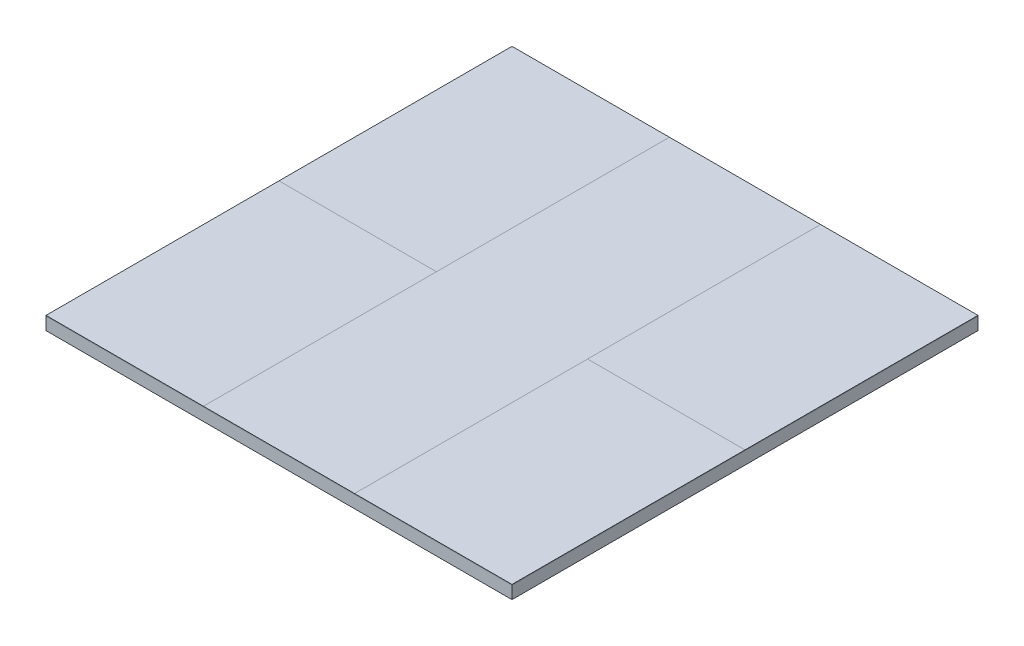
ISO-10303-21;
HEADER;
FILE_DESCRIPTION(('STEP AP214'),'2;1');
FILE_NAME('part.step','',(''),(''),'','','');
FILE_SCHEMA(('AUTOMOTIVE_DESIGN { 1 0 10303 214 1 1 1 1 }'));
ENDSEC;
DATA;
#1=APPLICATION_CONTEXT('core data for automotive mechanical design processes');
#2=APPLICATION_PROTOCOL_DEFINITION('international standard','automotive_design',2000,#1);
#3=PRODUCT_CONTEXT('',#1,'mechanical');
#4=PRODUCT('Part','Part','',(#3));
#5=PRODUCT_RELATED_PRODUCT_CATEGORY('part','',(#4));
#6=PRODUCT_DEFINITION_FORMATION('','',#4);
#7=PRODUCT_DEFINITION_CONTEXT('part definition',#1,'design');
#8=PRODUCT_DEFINITION('design','',#6,#7);
#9=PRODUCT_DEFINITION_SHAPE('','',#8);
#10=(LENGTH_UNIT() NAMED_UNIT(*) SI_UNIT(.MILLI.,.METRE.));
#11=(NAMED_UNIT(*) PLANE_ANGLE_UNIT() SI_UNIT($,.RADIAN.));
#12=(NAMED_UNIT(*) SI_UNIT($,.STERADIAN.) SOLID_ANGLE_UNIT());
#13=UNCERTAINTY_MEASURE_WITH_UNIT(LENGTH_MEASURE(1.E-05),#10,'distance_accuracy_value','');
#14=(GEOMETRIC_REPRESENTATION_CONTEXT(3) GLOBAL_UNCERTAINTY_ASSIGNED_CONTEXT((#13)) GLOBAL_UNIT_ASSIGNED_CONTEXT((#10,
#11,#12)) REPRESENTATION_CONTEXT('',''));
#15=CARTESIAN_POINT('',(0.,0.,0.));
#16=DIRECTION('',(0.,0.,1.));
#17=DIRECTION('',(1.,0.,0.));
#18=AXIS2_PLACEMENT_3D('',#15,#16,#17);
#19=CARTESIAN_POINT('',(12.,2.1,0.));
#20=DIRECTION('',(1.,0.,0.));
#21=DIRECTION('',(0.,0.,-1.));
#22=AXIS2_PLACEMENT_3D('',#19,#20,#21);
#23=PLANE('',#22);
#24=DIRECTION('',(0.,0.,1.));
#25=VECTOR('',#24,1.);
#26=CARTESIAN_POINT('',(12.,2.,0.));
#27=LINE('',#26,#25);
#28=CARTESIAN_POINT('',(12.,2.,-37.));
#29=VERTEX_POINT('',#28);
#30=CARTESIAN_POINT('',(12.,2.,0.));
#31=VERTEX_POINT('',#30);
#32=EDGE_CURVE('E108',#29,#31,#27,.T.);
#33=ORIENTED_EDGE('',*,*,#32,.T.);
#34=DIRECTION('',(0.,-1.,0.));
#35=VECTOR('',#34,1.);
#36=CARTESIAN_POINT('',(12.,2.1,0.));
#37=LINE('',#36,#35);
#38=CARTESIAN_POINT('',(12.,2.1,0.));
#39=VERTEX_POINT('',#38);
#40=EDGE_CURVE('E12',#39,#31,#37,.T.);
#41=ORIENTED_EDGE('',*,*,#40,.F.);
#42=DIRECTION('',(0.,0.,1.));
#43=VECTOR('',#42,1.);
#44=CARTESIAN_POINT('',(12.,2.1,0.));
#45=LINE('',#44,#43);
#46=CARTESIAN_POINT('',(12.,2.1,-37.));
#47=VERTEX_POINT('',#46);
#48=EDGE_CURVE('E96',#47,#39,#45,.T.);
#49=ORIENTED_EDGE('',*,*,#48,.F.);
#50=DIRECTION('',(0.,-1.,0.));
#51=VECTOR('',#50,1.);
#52=CARTESIAN_POINT('',(12.,2.1,-37.));
#53=LINE('',#52,#51);
#54=EDGE_CURVE('E104',#47,#29,#53,.T.);
#55=ORIENTED_EDGE('',*,*,#54,.T.);
#56=EDGE_LOOP('',(#33,#41,#49,#55));
#57=FACE_BOUND('',#56,.T.);
#58=ADVANCED_FACE('F45',(#57),#23,.F.);
#59=CARTESIAN_POINT('',(0.,2.1,0.));
#60=DIRECTION('',(0.,0.,-1.));
#61=DIRECTION('',(-1.,0.,0.));
#62=AXIS2_PLACEMENT_3D('',#59,#60,#61);
#63=PLANE('',#62);
#64=DIRECTION('',(1.,0.,0.));
#65=VECTOR('',#64,1.);
#66=CARTESIAN_POINT('',(0.,2.,0.));
#67=LINE('',#66,#65);
#68=CARTESIAN_POINT('',(37.,2.,0.));
#69=VERTEX_POINT('',#68);
#70=EDGE_CURVE('E100',#31,#69,#67,.T.);
#71=ORIENTED_EDGE('',*,*,#70,.T.);
#72=DIRECTION('',(0.,-1.,0.));
#73=VECTOR('',#72,1.);
#74=CARTESIAN_POINT('',(37.,2.1,0.));
#75=LINE('',#74,#73);
#76=CARTESIAN_POINT('',(37.,2.1,0.));
#77=VERTEX_POINT('',#76);
#78=EDGE_CURVE('E53',#77,#69,#75,.T.);
#79=ORIENTED_EDGE('',*,*,#78,.F.);
#80=DIRECTION('',(1.,0.,0.));
#81=VECTOR('',#80,1.);
#82=CARTESIAN_POINT('',(0.,2.1,0.));
#83=LINE('',#82,#81);
#84=EDGE_CURVE('E91',#39,#77,#83,.T.);
#85=ORIENTED_EDGE('',*,*,#84,.F.);
#86=ORIENTED_EDGE('',*,*,#40,.T.);
#87=EDGE_LOOP('',(#71,#79,#85,#86));
#88=FACE_BOUND('',#87,.T.);
#89=ADVANCED_FACE('F99',(#88),#63,.F.);
#90=CARTESIAN_POINT('',(37.,2.1,0.));
#91=DIRECTION('',(-1.,0.,0.));
#92=DIRECTION('',(0.,0.,1.));
#93=AXIS2_PLACEMENT_3D('',#90,#91,#92);
#94=PLANE('',#93);
#95=DIRECTION('',(0.,0.,-1.));
#96=VECTOR('',#95,1.);
#97=CARTESIAN_POINT('',(37.,2.,0.));
#98=LINE('',#97,#96);
#99=CARTESIAN_POINT('',(37.,2.,-37.));
#100=VERTEX_POINT('',#99);
#101=EDGE_CURVE('E78',#69,#100,#98,.T.);
#102=ORIENTED_EDGE('',*,*,#101,.T.);
#103=DIRECTION('',(0.,-1.,0.));
#104=VECTOR('',#103,1.);
#105=CARTESIAN_POINT('',(37.,2.1,-37.));
#106=LINE('',#105,#104);
#107=CARTESIAN_POINT('',(37.,2.1,-37.));
#108=VERTEX_POINT('',#107);
#109=EDGE_CURVE('E101',#108,#100,#106,.T.);
#110=ORIENTED_EDGE('',*,*,#109,.F.);
#111=DIRECTION('',(0.,0.,-1.));
#112=VECTOR('',#111,1.);
#113=CARTESIAN_POINT('',(37.,2.1,0.));
#114=LINE('',#113,#112);
#115=EDGE_CURVE('E94',#77,#108,#114,.T.);
#116=ORIENTED_EDGE('',*,*,#115,.F.);
#117=ORIENTED_EDGE('',*,*,#78,.T.);
#118=EDGE_LOOP('',(#102,#110,#116,#117));
#119=FACE_BOUND('',#118,.T.);
#120=ADVANCED_FACE('F102',(#119),#94,.F.);
#121=CARTESIAN_POINT('',(0.,2.1,-37.));
#122=DIRECTION('',(0.,0.,1.));
#123=DIRECTION('',(1.,0.,0.));
#124=AXIS2_PLACEMENT_3D('',#121,#122,#123);
#125=PLANE('',#124);
#126=DIRECTION('',(-1.,0.,0.));
#127=VECTOR('',#126,1.);
#128=CARTESIAN_POINT('',(0.,2.,-37.));
#129=LINE('',#128,#127);
#130=EDGE_CURVE('E84',#100,#29,#129,.T.);
#131=ORIENTED_EDGE('',*,*,#130,.T.);
#132=ORIENTED_EDGE('',*,*,#54,.F.);
#133=DIRECTION('',(-1.,0.,0.));
#134=VECTOR('',#133,1.);
#135=CARTESIAN_POINT('',(0.,2.1,-37.));
#136=LINE('',#135,#134);
#137=EDGE_CURVE('E61',#108,#47,#136,.T.);
#138=ORIENTED_EDGE('',*,*,#137,.F.);
#139=ORIENTED_EDGE('',*,*,#109,.T.);
#140=EDGE_LOOP('',(#131,#132,#138,#139));
#141=FACE_BOUND('',#140,.T.);
#142=ADVANCED_FACE('F115',(#141),#125,.F.);
#143=CARTESIAN_POINT('',(0.,2.1,0.));
#144=DIRECTION('',(0.,1.,0.));
#145=DIRECTION('',(0.,0.,1.));
#146=AXIS2_PLACEMENT_3D('',#143,#144,#145);
#147=PLANE('',#146);
#148=ORIENTED_EDGE('',*,*,#48,.T.);
#149=ORIENTED_EDGE('',*,*,#84,.T.);
#150=ORIENTED_EDGE('',*,*,#115,.T.);
#151=ORIENTED_EDGE('',*,*,#137,.T.);
#152=EDGE_LOOP('',(#148,#149,#150,#151));
#153=FACE_BOUND('',#152,.T.);
#154=ADVANCED_FACE('F92',(#153),#147,.T.);
#155=CARTESIAN_POINT('',(0.,2.,0.));
#156=DIRECTION('',(0.,1.,0.));
#157=DIRECTION('',(0.,0.,1.));
#158=AXIS2_PLACEMENT_3D('',#155,#156,#157);
#159=PLANE('',#158);
#160=ORIENTED_EDGE('',*,*,#32,.F.);
#161=ORIENTED_EDGE('',*,*,#130,.F.);
#162=ORIENTED_EDGE('',*,*,#101,.F.);
#163=ORIENTED_EDGE('',*,*,#70,.F.);
#164=EDGE_LOOP('',(#160,#161,#162,#163));
#165=FACE_BOUND('',#164,.T.);
#166=ADVANCED_FACE('F118',(#165),#159,.F.);
#167=CLOSED_SHELL('',(#58,#89,#120,#142,#154,#166));
#168=MANIFOLD_SOLID_BREP('B2',#167);
#169=CARTESIAN_POINT('',(12.,2.1,0.));
#170=DIRECTION('',(1.,0.,0.));
#171=DIRECTION('',(0.,0.,-1.));
#172=AXIS2_PLACEMENT_3D('',#169,#170,#171);
#173=PLANE('',#172);
#174=DIRECTION('',(0.,0.,1.));
#175=VECTOR('',#174,1.);
#176=CARTESIAN_POINT('',(12.,2.,0.));
#177=LINE('',#176,#175);
#178=CARTESIAN_POINT('',(12.,2.,-37.));
#179=VERTEX_POINT('',#178);
#180=CARTESIAN_POINT('',(12.,2.,37.));
#181=VERTEX_POINT('',#180);
#182=EDGE_CURVE('E251',#179,#181,#177,.T.);
#183=ORIENTED_EDGE('',*,*,#182,.F.);
#184=DIRECTION('',(0.,-1.,0.));
#185=VECTOR('',#184,1.);
#186=CARTESIAN_POINT('',(12.,2.1,-37.));
#187=LINE('',#186,#185);
#188=CARTESIAN_POINT('',(12.,2.1,-37.));
#189=VERTEX_POINT('',#188);
#190=EDGE_CURVE('E43',#189,#179,#187,.T.);
#191=ORIENTED_EDGE('',*,*,#190,.F.);
#192=DIRECTION('',(0.,0.,1.));
#193=VECTOR('',#192,1.);
#194=CARTESIAN_POINT('',(12.,2.1,0.));
#195=LINE('',#194,#193);
#196=CARTESIAN_POINT('',(12.,2.1,37.));
#197=VERTEX_POINT('',#196);
#198=EDGE_CURVE('E239',#189,#197,#195,.T.);
#199=ORIENTED_EDGE('',*,*,#198,.T.);
#200=DIRECTION('',(0.,-1.,0.));
#201=VECTOR('',#200,1.);
#202=CARTESIAN_POINT('',(12.,2.1,37.));
#203=LINE('',#202,#201);
#204=EDGE_CURVE('E228',#197,#181,#203,.T.);
#205=ORIENTED_EDGE('',*,*,#204,.T.);
#206=EDGE_LOOP('',(#183,#191,#199,#205));
#207=FACE_BOUND('',#206,.T.);
#208=ADVANCED_FACE('F189',(#207),#173,.T.);
#209=CARTESIAN_POINT('',(0.,2.1,-37.));
#210=DIRECTION('',(0.,0.,1.));
#211=DIRECTION('',(1.,0.,0.));
#212=AXIS2_PLACEMENT_3D('',#209,#210,#211);
#213=PLANE('',#212);
#214=DIRECTION('',(-1.,0.,0.));
#215=VECTOR('',#214,1.);
#216=CARTESIAN_POINT('',(0.,2.,-37.));
#217=LINE('',#216,#215);
#218=CARTESIAN_POINT('',(-12.,2.,-37.));
#219=VERTEX_POINT('',#218);
#220=EDGE_CURVE('E244',#179,#219,#217,.T.);
#221=ORIENTED_EDGE('',*,*,#220,.T.);
#222=DIRECTION('',(0.,-1.,0.));
#223=VECTOR('',#222,1.);
#224=CARTESIAN_POINT('',(-12.,2.1,-37.));
#225=LINE('',#224,#223);
#226=CARTESIAN_POINT('',(-12.,2.1,-37.));
#227=VERTEX_POINT('',#226);
#228=EDGE_CURVE('E197',#227,#219,#225,.T.);
#229=ORIENTED_EDGE('',*,*,#228,.F.);
#230=DIRECTION('',(-1.,0.,0.));
#231=VECTOR('',#230,1.);
#232=CARTESIAN_POINT('',(0.,2.1,-37.));
#233=LINE('',#232,#231);
#234=EDGE_CURVE('E234',#189,#227,#233,.T.);
#235=ORIENTED_EDGE('',*,*,#234,.F.);
#236=ORIENTED_EDGE('',*,*,#190,.T.);
#237=EDGE_LOOP('',(#221,#229,#235,#236));
#238=FACE_BOUND('',#237,.T.);
#239=ADVANCED_FACE('F242',(#238),#213,.F.);
#240=CARTESIAN_POINT('',(-12.,2.1,0.));
#241=DIRECTION('',(1.,0.,0.));
#242=DIRECTION('',(0.,0.,-1.));
#243=AXIS2_PLACEMENT_3D('',#240,#241,#242);
#244=PLANE('',#243);
#245=DIRECTION('',(0.,0.,1.));
#246=VECTOR('',#245,1.);
#247=CARTESIAN_POINT('',(-12.,2.,0.));
#248=LINE('',#247,#246);
#249=CARTESIAN_POINT('',(-12.,2.,37.));
#250=VERTEX_POINT('',#249);
#251=EDGE_CURVE('E221',#219,#250,#248,.T.);
#252=ORIENTED_EDGE('',*,*,#251,.T.);
#253=DIRECTION('',(0.,-1.,0.));
#254=VECTOR('',#253,1.);
#255=CARTESIAN_POINT('',(-12.,2.1,37.));
#256=LINE('',#255,#254);
#257=CARTESIAN_POINT('',(-12.,2.1,37.));
#258=VERTEX_POINT('',#257);
#259=EDGE_CURVE('E245',#258,#250,#256,.T.);
#260=ORIENTED_EDGE('',*,*,#259,.F.);
#261=DIRECTION('',(0.,0.,1.));
#262=VECTOR('',#261,1.);
#263=CARTESIAN_POINT('',(-12.,2.1,0.));
#264=LINE('',#263,#262);
#265=EDGE_CURVE('E238',#227,#258,#264,.T.);
#266=ORIENTED_EDGE('',*,*,#265,.F.);
#267=ORIENTED_EDGE('',*,*,#228,.T.);
#268=EDGE_LOOP('',(#252,#260,#266,#267));
#269=FACE_BOUND('',#268,.T.);
#270=ADVANCED_FACE('F246',(#269),#244,.F.);
#271=CARTESIAN_POINT('',(0.,2.1,37.));
#272=DIRECTION('',(0.,0.,-1.));
#273=DIRECTION('',(-1.,0.,0.));
#274=AXIS2_PLACEMENT_3D('',#271,#272,#273);
#275=PLANE('',#274);
#276=DIRECTION('',(1.,0.,0.));
#277=VECTOR('',#276,1.);
#278=CARTESIAN_POINT('',(0.,2.,37.));
#279=LINE('',#278,#277);
#280=EDGE_CURVE('E256',#250,#181,#279,.T.);
#281=ORIENTED_EDGE('',*,*,#280,.T.);
#282=ORIENTED_EDGE('',*,*,#204,.F.);
#283=DIRECTION('',(1.,0.,0.));
#284=VECTOR('',#283,1.);
#285=CARTESIAN_POINT('',(0.,2.1,37.));
#286=LINE('',#285,#284);
#287=EDGE_CURVE('E205',#258,#197,#286,.T.);
#288=ORIENTED_EDGE('',*,*,#287,.F.);
#289=ORIENTED_EDGE('',*,*,#259,.T.);
#290=EDGE_LOOP('',(#281,#282,#288,#289));
#291=FACE_BOUND('',#290,.T.);
#292=ADVANCED_FACE('F261',(#291),#275,.F.);
#293=CARTESIAN_POINT('',(0.,2.1,0.));
#294=DIRECTION('',(0.,1.,0.));
#295=DIRECTION('',(0.,0.,1.));
#296=AXIS2_PLACEMENT_3D('',#293,#294,#295);
#297=PLANE('',#296);
#298=ORIENTED_EDGE('',*,*,#198,.F.);
#299=ORIENTED_EDGE('',*,*,#234,.T.);
#300=ORIENTED_EDGE('',*,*,#265,.T.);
#301=ORIENTED_EDGE('',*,*,#287,.T.);
#302=EDGE_LOOP('',(#298,#299,#300,#301));
#303=FACE_BOUND('',#302,.T.);
#304=ADVANCED_FACE('F236',(#303),#297,.T.);
#305=CARTESIAN_POINT('',(0.,2.,0.));
#306=DIRECTION('',(0.,1.,0.));
#307=DIRECTION('',(0.,0.,1.));
#308=AXIS2_PLACEMENT_3D('',#305,#306,#307);
#309=PLANE('',#308);
#310=ORIENTED_EDGE('',*,*,#182,.T.);
#311=ORIENTED_EDGE('',*,*,#280,.F.);
#312=ORIENTED_EDGE('',*,*,#251,.F.);
#313=ORIENTED_EDGE('',*,*,#220,.F.);
#314=EDGE_LOOP('',(#310,#311,#312,#313));
#315=FACE_BOUND('',#314,.T.);
#316=ADVANCED_FACE('F263',(#315),#309,.F.);
#317=CLOSED_SHELL('',(#208,#239,#270,#292,#304,#316));
#318=MANIFOLD_SOLID_BREP('B6',#317);
#319=CARTESIAN_POINT('',(0.,2.1,0.));
#320=DIRECTION('',(0.,0.,-1.));
#321=DIRECTION('',(-1.,0.,0.));
#322=AXIS2_PLACEMENT_3D('',#319,#320,#321);
#323=PLANE('',#322);
#324=DIRECTION('',(1.,0.,0.));
#325=VECTOR('',#324,1.);
#326=CARTESIAN_POINT('',(0.,2.,0.));
#327=LINE('',#326,#325);
#328=CARTESIAN_POINT('',(-37.,2.,0.));
#329=VERTEX_POINT('',#328);
#330=CARTESIAN_POINT('',(-12.,2.,0.));
#331=VERTEX_POINT('',#330);
#332=EDGE_CURVE('E397',#329,#331,#327,.T.);
#333=ORIENTED_EDGE('',*,*,#332,.F.);
#334=DIRECTION('',(0.,-1.,0.));
#335=VECTOR('',#334,1.);
#336=CARTESIAN_POINT('',(-37.,2.1,0.));
#337=LINE('',#336,#335);
#338=CARTESIAN_POINT('',(-37.,2.1,0.));
#339=VERTEX_POINT('',#338);
#340=EDGE_CURVE('E187',#339,#329,#337,.T.);
#341=ORIENTED_EDGE('',*,*,#340,.F.);
#342=DIRECTION('',(1.,0.,0.));
#343=VECTOR('',#342,1.);
#344=CARTESIAN_POINT('',(0.,2.1,0.));
#345=LINE('',#344,#343);
#346=CARTESIAN_POINT('',(-12.,2.1,0.));
#347=VERTEX_POINT('',#346);
#348=EDGE_CURVE('E382',#339,#347,#345,.T.);
#349=ORIENTED_EDGE('',*,*,#348,.T.);
#350=DIRECTION('',(0.,-1.,0.));
#351=VECTOR('',#350,1.);
#352=CARTESIAN_POINT('',(-12.,2.1,0.));
#353=LINE('',#352,#351);
#354=EDGE_CURVE('E350',#347,#331,#353,.T.);
#355=ORIENTED_EDGE('',*,*,#354,.T.);
#356=EDGE_LOOP('',(#333,#341,#349,#355));
#357=FACE_BOUND('',#356,.T.);
#358=ADVANCED_FACE('F334',(#357),#323,.T.);
#359=CARTESIAN_POINT('',(-37.,2.1,0.));
#360=DIRECTION('',(1.,0.,0.));
#361=DIRECTION('',(0.,0.,-1.));
#362=AXIS2_PLACEMENT_3D('',#359,#360,#361);
#363=PLANE('',#362);
#364=DIRECTION('',(0.,0.,1.));
#365=VECTOR('',#364,1.);
#366=CARTESIAN_POINT('',(-37.,2.,0.));
#367=LINE('',#366,#365);
#368=CARTESIAN_POINT('',(-37.,2.,37.));
#369=VERTEX_POINT('',#368);
#370=EDGE_CURVE('E388',#329,#369,#367,.T.);
#371=ORIENTED_EDGE('',*,*,#370,.T.);
#372=DIRECTION('',(0.,-1.,0.));
#373=VECTOR('',#372,1.);
#374=CARTESIAN_POINT('',(-37.,2.1,37.));
#375=LINE('',#374,#373);
#376=CARTESIAN_POINT('',(-37.,2.1,37.));
#377=VERTEX_POINT('',#376);
#378=EDGE_CURVE('E342',#377,#369,#375,.T.);
#379=ORIENTED_EDGE('',*,*,#378,.F.);
#380=DIRECTION('',(0.,0.,1.));
#381=VECTOR('',#380,1.);
#382=CARTESIAN_POINT('',(-37.,2.1,0.));
#383=LINE('',#382,#381);
#384=EDGE_CURVE('E376',#339,#377,#383,.T.);
#385=ORIENTED_EDGE('',*,*,#384,.F.);
#386=ORIENTED_EDGE('',*,*,#340,.T.);
#387=EDGE_LOOP('',(#371,#379,#385,#386));
#388=FACE_BOUND('',#387,.T.);
#389=ADVANCED_FACE('F386',(#388),#363,.F.);
#390=CARTESIAN_POINT('',(0.,2.1,37.));
#391=DIRECTION('',(0.,0.,-1.));
#392=DIRECTION('',(-1.,0.,0.));
#393=AXIS2_PLACEMENT_3D('',#390,#391,#392);
#394=PLANE('',#393);
#395=DIRECTION('',(1.,0.,0.));
#396=VECTOR('',#395,1.);
#397=CARTESIAN_POINT('',(0.,2.,37.));
#398=LINE('',#397,#396);
#399=CARTESIAN_POINT('',(-12.,2.,37.));
#400=VERTEX_POINT('',#399);
#401=EDGE_CURVE('E400',#369,#400,#398,.T.);
#402=ORIENTED_EDGE('',*,*,#401,.T.);
#403=DIRECTION('',(0.,-1.,0.));
#404=VECTOR('',#403,1.);
#405=CARTESIAN_POINT('',(-12.,2.1,37.));
#406=LINE('',#405,#404);
#407=CARTESIAN_POINT('',(-12.,2.1,37.));
#408=VERTEX_POINT('',#407);
#409=EDGE_CURVE('E364',#408,#400,#406,.T.);
#410=ORIENTED_EDGE('',*,*,#409,.F.);
#411=DIRECTION('',(1.,0.,0.));
#412=VECTOR('',#411,1.);
#413=CARTESIAN_POINT('',(0.,2.1,37.));
#414=LINE('',#413,#412);
#415=EDGE_CURVE('E381',#377,#408,#414,.T.);
#416=ORIENTED_EDGE('',*,*,#415,.F.);
#417=ORIENTED_EDGE('',*,*,#378,.T.);
#418=EDGE_LOOP('',(#402,#410,#416,#417));
#419=FACE_BOUND('',#418,.T.);
#420=ADVANCED_FACE('F391',(#419),#394,.F.);
#421=CARTESIAN_POINT('',(-12.,2.1,0.));
#422=DIRECTION('',(1.,0.,0.));
#423=DIRECTION('',(0.,0.,-1.));
#424=AXIS2_PLACEMENT_3D('',#421,#422,#423);
#425=PLANE('',#424);
#426=DIRECTION('',(0.,0.,1.));
#427=VECTOR('',#426,1.);
#428=CARTESIAN_POINT('',(-12.,2.,0.));
#429=LINE('',#428,#427);
#430=EDGE_CURVE('E402',#331,#400,#429,.T.);
#431=ORIENTED_EDGE('',*,*,#430,.F.);
#432=ORIENTED_EDGE('',*,*,#354,.F.);
#433=DIRECTION('',(0.,0.,1.));
#434=VECTOR('',#433,1.);
#435=CARTESIAN_POINT('',(-12.,2.1,0.));
#436=LINE('',#435,#434);
#437=EDGE_CURVE('E392',#347,#408,#436,.T.);
#438=ORIENTED_EDGE('',*,*,#437,.T.);
#439=ORIENTED_EDGE('',*,*,#409,.T.);
#440=EDGE_LOOP('',(#431,#432,#438,#439));
#441=FACE_BOUND('',#440,.T.);
#442=ADVANCED_FACE('F407',(#441),#425,.T.);
#443=CARTESIAN_POINT('',(0.,2.1,0.));
#444=DIRECTION('',(0.,1.,0.));
#445=DIRECTION('',(0.,0.,1.));
#446=AXIS2_PLACEMENT_3D('',#443,#444,#445);
#447=PLANE('',#446);
#448=ORIENTED_EDGE('',*,*,#348,.F.);
#449=ORIENTED_EDGE('',*,*,#384,.T.);
#450=ORIENTED_EDGE('',*,*,#415,.T.);
#451=ORIENTED_EDGE('',*,*,#437,.F.);
#452=EDGE_LOOP('',(#448,#449,#450,#451));
#453=FACE_BOUND('',#452,.T.);
#454=ADVANCED_FACE('F378',(#453),#447,.T.);
#455=CARTESIAN_POINT('',(0.,2.,0.));
#456=DIRECTION('',(0.,1.,0.));
#457=DIRECTION('',(0.,0.,1.));
#458=AXIS2_PLACEMENT_3D('',#455,#456,#457);
#459=PLANE('',#458);
#460=ORIENTED_EDGE('',*,*,#332,.T.);
#461=ORIENTED_EDGE('',*,*,#430,.T.);
#462=ORIENTED_EDGE('',*,*,#401,.F.);
#463=ORIENTED_EDGE('',*,*,#370,.F.);
#464=EDGE_LOOP('',(#460,#461,#462,#463));
#465=FACE_BOUND('',#464,.T.);
#466=ADVANCED_FACE('F414',(#465),#459,.F.);
#467=CLOSED_SHELL('',(#358,#389,#420,#442,#454,#466));
#468=MANIFOLD_SOLID_BREP('B37',#467);
#469=CARTESIAN_POINT('',(0.,2.1,0.));
#470=DIRECTION('',(0.,0.,-1.));
#471=DIRECTION('',(-1.,0.,0.));
#472=AXIS2_PLACEMENT_3D('',#469,#470,#471);
#473=PLANE('',#472);
#474=DIRECTION('',(1.,0.,0.));
#475=VECTOR('',#474,1.);
#476=CARTESIAN_POINT('',(0.,2.,0.));
#477=LINE('',#476,#475);
#478=CARTESIAN_POINT('',(12.,2.,0.));
#479=VERTEX_POINT('',#478);
#480=CARTESIAN_POINT('',(37.,2.,0.));
#481=VERTEX_POINT('',#480);
#482=EDGE_CURVE('E540',#479,#481,#477,.T.);
#483=ORIENTED_EDGE('',*,*,#482,.F.);
#484=DIRECTION('',(0.,-1.,0.));
#485=VECTOR('',#484,1.);
#486=CARTESIAN_POINT('',(12.,2.1,0.));
#487=LINE('',#486,#485);
#488=CARTESIAN_POINT('',(12.,2.1,0.));
#489=VERTEX_POINT('',#488);
#490=EDGE_CURVE('E332',#489,#479,#487,.T.);
#491=ORIENTED_EDGE('',*,*,#490,.F.);
#492=DIRECTION('',(1.,0.,0.));
#493=VECTOR('',#492,1.);
#494=CARTESIAN_POINT('',(0.,2.1,0.));
#495=LINE('',#494,#493);
#496=CARTESIAN_POINT('',(37.,2.1,0.));
#497=VERTEX_POINT('',#496);
#498=EDGE_CURVE('E528',#489,#497,#495,.T.);
#499=ORIENTED_EDGE('',*,*,#498,.T.);
#500=DIRECTION('',(0.,-1.,0.));
#501=VECTOR('',#500,1.);
#502=CARTESIAN_POINT('',(37.,2.1,0.));
#503=LINE('',#502,#501);
#504=EDGE_CURVE('E517',#497,#481,#503,.T.);
#505=ORIENTED_EDGE('',*,*,#504,.T.);
#506=EDGE_LOOP('',(#483,#491,#499,#505));
#507=FACE_BOUND('',#506,.T.);
#508=ADVANCED_FACE('F478',(#507),#473,.T.);
#509=CARTESIAN_POINT('',(12.,2.1,0.));
#510=DIRECTION('',(1.,0.,0.));
#511=DIRECTION('',(0.,0.,-1.));
#512=AXIS2_PLACEMENT_3D('',#509,#510,#511);
#513=PLANE('',#512);
#514=DIRECTION('',(0.,0.,1.));
#515=VECTOR('',#514,1.);
#516=CARTESIAN_POINT('',(12.,2.,0.));
#517=LINE('',#516,#515);
#518=CARTESIAN_POINT('',(12.,2.,37.));
#519=VERTEX_POINT('',#518);
#520=EDGE_CURVE('E533',#479,#519,#517,.T.);
#521=ORIENTED_EDGE('',*,*,#520,.T.);
#522=DIRECTION('',(0.,-1.,0.));
#523=VECTOR('',#522,1.);
#524=CARTESIAN_POINT('',(12.,2.1,37.));
#525=LINE('',#524,#523);
#526=CARTESIAN_POINT('',(12.,2.1,37.));
#527=VERTEX_POINT('',#526);
#528=EDGE_CURVE('E486',#527,#519,#525,.T.);
#529=ORIENTED_EDGE('',*,*,#528,.F.);
#530=DIRECTION('',(0.,0.,1.));
#531=VECTOR('',#530,1.);
#532=CARTESIAN_POINT('',(12.,2.1,0.));
#533=LINE('',#532,#531);
#534=EDGE_CURVE('E523',#489,#527,#533,.T.);
#535=ORIENTED_EDGE('',*,*,#534,.F.);
#536=ORIENTED_EDGE('',*,*,#490,.T.);
#537=EDGE_LOOP('',(#521,#529,#535,#536));
#538=FACE_BOUND('',#537,.T.);
#539=ADVANCED_FACE('F531',(#538),#513,.F.);
#540=CARTESIAN_POINT('',(0.,2.1,37.));
#541=DIRECTION('',(0.,0.,-1.));
#542=DIRECTION('',(-1.,0.,0.));
#543=AXIS2_PLACEMENT_3D('',#540,#541,#542);
#544=PLANE('',#543);
#545=DIRECTION('',(1.,0.,0.));
#546=VECTOR('',#545,1.);
#547=CARTESIAN_POINT('',(0.,2.,37.));
#548=LINE('',#547,#546);
#549=CARTESIAN_POINT('',(37.,2.,37.));
#550=VERTEX_POINT('',#549);
#551=EDGE_CURVE('E510',#519,#550,#548,.T.);
#552=ORIENTED_EDGE('',*,*,#551,.T.);
#553=DIRECTION('',(0.,-1.,0.));
#554=VECTOR('',#553,1.);
#555=CARTESIAN_POINT('',(37.,2.1,37.));
#556=LINE('',#555,#554);
#557=CARTESIAN_POINT('',(37.,2.1,37.));
#558=VERTEX_POINT('',#557);
#559=EDGE_CURVE('E534',#558,#550,#556,.T.);
#560=ORIENTED_EDGE('',*,*,#559,.F.);
#561=DIRECTION('',(1.,0.,0.));
#562=VECTOR('',#561,1.);
#563=CARTESIAN_POINT('',(0.,2.1,37.));
#564=LINE('',#563,#562);
#565=EDGE_CURVE('E527',#527,#558,#564,.T.);
#566=ORIENTED_EDGE('',*,*,#565,.F.);
#567=ORIENTED_EDGE('',*,*,#528,.T.);
#568=EDGE_LOOP('',(#552,#560,#566,#567));
#569=FACE_BOUND('',#568,.T.);
#570=ADVANCED_FACE('F535',(#569),#544,.F.);
#571=CARTESIAN_POINT('',(37.,2.1,0.));
#572=DIRECTION('',(-1.,0.,0.));
#573=DIRECTION('',(0.,0.,1.));
#574=AXIS2_PLACEMENT_3D('',#571,#572,#573);
#575=PLANE('',#574);
#576=DIRECTION('',(0.,0.,-1.));
#577=VECTOR('',#576,1.);
#578=CARTESIAN_POINT('',(37.,2.,0.));
#579=LINE('',#578,#577);
#580=EDGE_CURVE('E545',#550,#481,#579,.T.);
#581=ORIENTED_EDGE('',*,*,#580,.T.);
#582=ORIENTED_EDGE('',*,*,#504,.F.);
#583=DIRECTION('',(0.,0.,-1.));
#584=VECTOR('',#583,1.);
#585=CARTESIAN_POINT('',(37.,2.1,0.));
#586=LINE('',#585,#584);
#587=EDGE_CURVE('E494',#558,#497,#586,.T.);
#588=ORIENTED_EDGE('',*,*,#587,.F.);
#589=ORIENTED_EDGE('',*,*,#559,.T.);
#590=EDGE_LOOP('',(#581,#582,#588,#589));
#591=FACE_BOUND('',#590,.T.);
#592=ADVANCED_FACE('F550',(#591),#575,.F.);
#593=CARTESIAN_POINT('',(0.,2.1,0.));
#594=DIRECTION('',(0.,1.,0.));
#595=DIRECTION('',(0.,0.,1.));
#596=AXIS2_PLACEMENT_3D('',#593,#594,#595);
#597=PLANE('',#596);
#598=ORIENTED_EDGE('',*,*,#498,.F.);
#599=ORIENTED_EDGE('',*,*,#534,.T.);
#600=ORIENTED_EDGE('',*,*,#565,.T.);
#601=ORIENTED_EDGE('',*,*,#587,.T.);
#602=EDGE_LOOP('',(#598,#599,#600,#601));
#603=FACE_BOUND('',#602,.T.);
#604=ADVANCED_FACE('F525',(#603),#597,.T.);
#605=CARTESIAN_POINT('',(0.,2.,0.));
#606=DIRECTION('',(0.,1.,0.));
#607=DIRECTION('',(0.,0.,1.));
#608=AXIS2_PLACEMENT_3D('',#605,#606,#607);
#609=PLANE('',#608);
#610=ORIENTED_EDGE('',*,*,#482,.T.);
#611=ORIENTED_EDGE('',*,*,#580,.F.);
#612=ORIENTED_EDGE('',*,*,#551,.F.);
#613=ORIENTED_EDGE('',*,*,#520,.F.);
#614=EDGE_LOOP('',(#610,#611,#612,#613));
#615=FACE_BOUND('',#614,.T.);
#616=ADVANCED_FACE('F552',(#615),#609,.F.);
#617=CLOSED_SHELL('',(#508,#539,#570,#592,#604,#616));
#618=MANIFOLD_SOLID_BREP('B181',#617);
#619=CARTESIAN_POINT('',(-37.,2.1,0.));
#620=DIRECTION('',(1.,0.,0.));
#621=DIRECTION('',(0.,0.,-1.));
#622=AXIS2_PLACEMENT_3D('',#619,#620,#621);
#623=PLANE('',#622);
#624=DIRECTION('',(0.,0.,1.));
#625=VECTOR('',#624,1.);
#626=CARTESIAN_POINT('',(-37.,2.,0.));
#627=LINE('',#626,#625);
#628=CARTESIAN_POINT('',(-37.,2.,-37.));
#629=VERTEX_POINT('',#628);
#630=CARTESIAN_POINT('',(-37.,2.,0.));
#631=VERTEX_POINT('',#630);
#632=EDGE_CURVE('E683',#629,#631,#627,.T.);
#633=ORIENTED_EDGE('',*,*,#632,.T.);
#634=DIRECTION('',(0.,-1.,0.));
#635=VECTOR('',#634,1.);
#636=CARTESIAN_POINT('',(-37.,2.1,0.));
#637=LINE('',#636,#635);
#638=CARTESIAN_POINT('',(-37.,2.1,0.));
#639=VERTEX_POINT('',#638);
#640=EDGE_CURVE('E476',#639,#631,#637,.T.);
#641=ORIENTED_EDGE('',*,*,#640,.F.);
#642=DIRECTION('',(0.,0.,1.));
#643=VECTOR('',#642,1.);
#644=CARTESIAN_POINT('',(-37.,2.1,0.));
#645=LINE('',#644,#643);
#646=CARTESIAN_POINT('',(-37.,2.1,-37.));
#647=VERTEX_POINT('',#646);
#648=EDGE_CURVE('E668',#647,#639,#645,.T.);
#649=ORIENTED_EDGE('',*,*,#648,.F.);
#650=DIRECTION('',(0.,-1.,0.));
#651=VECTOR('',#650,1.);
#652=CARTESIAN_POINT('',(-37.,2.1,-37.));
#653=LINE('',#652,#651);
#654=EDGE_CURVE('E679',#647,#629,#653,.T.);
#655=ORIENTED_EDGE('',*,*,#654,.T.);
#656=EDGE_LOOP('',(#633,#641,#649,#655));
#657=FACE_BOUND('',#656,.T.);
#658=ADVANCED_FACE('F621',(#657),#623,.F.);
#659=CARTESIAN_POINT('',(0.,2.1,0.));
#660=DIRECTION('',(0.,0.,-1.));
#661=DIRECTION('',(-1.,0.,0.));
#662=AXIS2_PLACEMENT_3D('',#659,#660,#661);
#663=PLANE('',#662);
#664=DIRECTION('',(1.,0.,0.));
#665=VECTOR('',#664,1.);
#666=CARTESIAN_POINT('',(0.,2.,0.));
#667=LINE('',#666,#665);
#668=CARTESIAN_POINT('',(-12.,2.,0.));
#669=VERTEX_POINT('',#668);
#670=EDGE_CURVE('E673',#631,#669,#667,.T.);
#671=ORIENTED_EDGE('',*,*,#670,.T.);
#672=DIRECTION('',(0.,-1.,0.));
#673=VECTOR('',#672,1.);
#674=CARTESIAN_POINT('',(-12.,2.1,0.));
#675=LINE('',#674,#673);
#676=CARTESIAN_POINT('',(-12.,2.1,0.));
#677=VERTEX_POINT('',#676);
#678=EDGE_CURVE('E629',#677,#669,#675,.T.);
#679=ORIENTED_EDGE('',*,*,#678,.F.);
#680=DIRECTION('',(1.,0.,0.));
#681=VECTOR('',#680,1.);
#682=CARTESIAN_POINT('',(0.,2.1,0.));
#683=LINE('',#682,#681);
#684=EDGE_CURVE('E663',#639,#677,#683,.T.);
#685=ORIENTED_EDGE('',*,*,#684,.F.);
#686=ORIENTED_EDGE('',*,*,#640,.T.);
#687=EDGE_LOOP('',(#671,#679,#685,#686));
#688=FACE_BOUND('',#687,.T.);
#689=ADVANCED_FACE('F672',(#688),#663,.F.);
#690=CARTESIAN_POINT('',(-12.,2.1,0.));
#691=DIRECTION('',(1.,0.,0.));
#692=DIRECTION('',(0.,0.,-1.));
#693=AXIS2_PLACEMENT_3D('',#690,#691,#692);
#694=PLANE('',#693);
#695=DIRECTION('',(0.,0.,1.));
#696=VECTOR('',#695,1.);
#697=CARTESIAN_POINT('',(-12.,2.,0.));
#698=LINE('',#697,#696);
#699=CARTESIAN_POINT('',(-12.,2.,-37.));
#700=VERTEX_POINT('',#699);
#701=EDGE_CURVE('E687',#700,#669,#698,.T.);
#702=ORIENTED_EDGE('',*,*,#701,.F.);
#703=DIRECTION('',(0.,-1.,0.));
#704=VECTOR('',#703,1.);
#705=CARTESIAN_POINT('',(-12.,2.1,-37.));
#706=LINE('',#705,#704);
#707=CARTESIAN_POINT('',(-12.,2.1,-37.));
#708=VERTEX_POINT('',#707);
#709=EDGE_CURVE('E653',#708,#700,#706,.T.);
#710=ORIENTED_EDGE('',*,*,#709,.F.);
#711=DIRECTION('',(0.,0.,1.));
#712=VECTOR('',#711,1.);
#713=CARTESIAN_POINT('',(-12.,2.1,0.));
#714=LINE('',#713,#712);
#715=EDGE_CURVE('E666',#708,#677,#714,.T.);
#716=ORIENTED_EDGE('',*,*,#715,.T.);
#717=ORIENTED_EDGE('',*,*,#678,.T.);
#718=EDGE_LOOP('',(#702,#710,#716,#717));
#719=FACE_BOUND('',#718,.T.);
#720=ADVANCED_FACE('F677',(#719),#694,.T.);
#721=CARTESIAN_POINT('',(0.,2.1,-37.));
#722=DIRECTION('',(0.,0.,1.));
#723=DIRECTION('',(1.,0.,0.));
#724=AXIS2_PLACEMENT_3D('',#721,#722,#723);
#725=PLANE('',#724);
#726=DIRECTION('',(-1.,0.,0.));
#727=VECTOR('',#726,1.);
#728=CARTESIAN_POINT('',(0.,2.,-37.));
#729=LINE('',#728,#727);
#730=EDGE_CURVE('E656',#700,#629,#729,.T.);
#731=ORIENTED_EDGE('',*,*,#730,.T.);
#732=ORIENTED_EDGE('',*,*,#654,.F.);
#733=DIRECTION('',(-1.,0.,0.));
#734=VECTOR('',#733,1.);
#735=CARTESIAN_POINT('',(0.,2.1,-37.));
#736=LINE('',#735,#734);
#737=EDGE_CURVE('E637',#708,#647,#736,.T.);
#738=ORIENTED_EDGE('',*,*,#737,.F.);
#739=ORIENTED_EDGE('',*,*,#709,.T.);
#740=EDGE_LOOP('',(#731,#732,#738,#739));
#741=FACE_BOUND('',#740,.T.);
#742=ADVANCED_FACE('F700',(#741),#725,.F.);
#743=CARTESIAN_POINT('',(0.,2.1,0.));
#744=DIRECTION('',(0.,1.,0.));
#745=DIRECTION('',(0.,0.,1.));
#746=AXIS2_PLACEMENT_3D('',#743,#744,#745);
#747=PLANE('',#746);
#748=ORIENTED_EDGE('',*,*,#648,.T.);
#749=ORIENTED_EDGE('',*,*,#684,.T.);
#750=ORIENTED_EDGE('',*,*,#715,.F.);
#751=ORIENTED_EDGE('',*,*,#737,.T.);
#752=EDGE_LOOP('',(#748,#749,#750,#751));
#753=FACE_BOUND('',#752,.T.);
#754=ADVANCED_FACE('F664',(#753),#747,.T.);
#755=CARTESIAN_POINT('',(0.,2.,0.));
#756=DIRECTION('',(0.,1.,0.));
#757=DIRECTION('',(0.,0.,1.));
#758=AXIS2_PLACEMENT_3D('',#755,#756,#757);
#759=PLANE('',#758);
#760=ORIENTED_EDGE('',*,*,#632,.F.);
#761=ORIENTED_EDGE('',*,*,#730,.F.);
#762=ORIENTED_EDGE('',*,*,#701,.T.);
#763=ORIENTED_EDGE('',*,*,#670,.F.);
#764=EDGE_LOOP('',(#760,#761,#762,#763));
#765=FACE_BOUND('',#764,.T.);
#766=ADVANCED_FACE('F694',(#765),#759,.F.);
#767=CLOSED_SHELL('',(#658,#689,#720,#742,#754,#766));
#768=MANIFOLD_SOLID_BREP('B326',#767);
#769=CARTESIAN_POINT('',(-37.,2.,37.));
#770=DIRECTION('',(1.,0.,0.));
#771=DIRECTION('',(0.,0.,-1.));
#772=AXIS2_PLACEMENT_3D('',#769,#770,#771);
#773=PLANE('',#772);
#774=DIRECTION('',(0.,0.,1.));
#775=VECTOR('',#774,1.);
#776=CARTESIAN_POINT('',(-37.,0.,37.));
#777=LINE('',#776,#775);
#778=CARTESIAN_POINT('',(-37.,0.,-37.));
#779=VERTEX_POINT('',#778);
#780=CARTESIAN_POINT('',(-37.,0.,37.));
#781=VERTEX_POINT('',#780);
#782=EDGE_CURVE('E816',#779,#781,#777,.T.);
#783=ORIENTED_EDGE('',*,*,#782,.T.);
#784=DIRECTION('',(0.,-1.,0.));
#785=VECTOR('',#784,1.);
#786=CARTESIAN_POINT('',(-37.,2.,37.));
#787=LINE('',#786,#785);
#788=CARTESIAN_POINT('',(-37.,2.,37.));
#789=VERTEX_POINT('',#788);
#790=EDGE_CURVE('E619',#789,#781,#787,.T.);
#791=ORIENTED_EDGE('',*,*,#790,.F.);
#792=DIRECTION('',(0.,0.,1.));
#793=VECTOR('',#792,1.);
#794=CARTESIAN_POINT('',(-37.,2.,37.));
#795=LINE('',#794,#793);
#796=CARTESIAN_POINT('',(-37.,2.,-37.));
#797=VERTEX_POINT('',#796);
#798=EDGE_CURVE('E804',#797,#789,#795,.T.);
#799=ORIENTED_EDGE('',*,*,#798,.F.);
#800=DIRECTION('',(0.,-1.,0.));
#801=VECTOR('',#800,1.);
#802=CARTESIAN_POINT('',(-37.,2.,-37.));
#803=LINE('',#802,#801);
#804=EDGE_CURVE('E812',#797,#779,#803,.T.);
#805=ORIENTED_EDGE('',*,*,#804,.T.);
#806=EDGE_LOOP('',(#783,#791,#799,#805));
#807=FACE_BOUND('',#806,.T.);
#808=ADVANCED_FACE('F753',(#807),#773,.F.);
#809=CARTESIAN_POINT('',(37.,2.,37.));
#810=DIRECTION('',(0.,0.,-1.));
#811=DIRECTION('',(-1.,0.,0.));
#812=AXIS2_PLACEMENT_3D('',#809,#810,#811);
#813=PLANE('',#812);
#814=DIRECTION('',(1.,0.,0.));
#815=VECTOR('',#814,1.);
#816=CARTESIAN_POINT('',(37.,0.,37.));
#817=LINE('',#816,#815);
#818=CARTESIAN_POINT('',(37.,0.,37.));
#819=VERTEX_POINT('',#818);
#820=EDGE_CURVE('E808',#781,#819,#817,.T.);
#821=ORIENTED_EDGE('',*,*,#820,.T.);
#822=DIRECTION('',(0.,-1.,0.));
#823=VECTOR('',#822,1.);
#824=CARTESIAN_POINT('',(37.,2.,37.));
#825=LINE('',#824,#823);
#826=CARTESIAN_POINT('',(37.,2.,37.));
#827=VERTEX_POINT('',#826);
#828=EDGE_CURVE('E761',#827,#819,#825,.T.);
#829=ORIENTED_EDGE('',*,*,#828,.F.);
#830=DIRECTION('',(1.,0.,0.));
#831=VECTOR('',#830,1.);
#832=CARTESIAN_POINT('',(37.,2.,37.));
#833=LINE('',#832,#831);
#834=EDGE_CURVE('E799',#789,#827,#833,.T.);
#835=ORIENTED_EDGE('',*,*,#834,.F.);
#836=ORIENTED_EDGE('',*,*,#790,.T.);
#837=EDGE_LOOP('',(#821,#829,#835,#836));
#838=FACE_BOUND('',#837,.T.);
#839=ADVANCED_FACE('F807',(#838),#813,.F.);
#840=CARTESIAN_POINT('',(37.,2.,37.));
#841=DIRECTION('',(-1.,0.,0.));
#842=DIRECTION('',(0.,0.,1.));
#843=AXIS2_PLACEMENT_3D('',#840,#841,#842);
#844=PLANE('',#843);
#845=DIRECTION('',(0.,0.,-1.));
#846=VECTOR('',#845,1.);
#847=CARTESIAN_POINT('',(37.,0.,37.));
#848=LINE('',#847,#846);
#849=CARTESIAN_POINT('',(37.,0.,-37.));
#850=VERTEX_POINT('',#849);
#851=EDGE_CURVE('E786',#819,#850,#848,.T.);
#852=ORIENTED_EDGE('',*,*,#851,.T.);
#853=DIRECTION('',(0.,-1.,0.));
#854=VECTOR('',#853,1.);
#855=CARTESIAN_POINT('',(37.,2.,-37.));
#856=LINE('',#855,#854);
#857=CARTESIAN_POINT('',(37.,2.,-37.));
#858=VERTEX_POINT('',#857);
#859=EDGE_CURVE('E809',#858,#850,#856,.T.);
#860=ORIENTED_EDGE('',*,*,#859,.F.);
#861=DIRECTION('',(0.,0.,-1.));
#862=VECTOR('',#861,1.);
#863=CARTESIAN_POINT('',(37.,2.,37.));
#864=LINE('',#863,#862);
#865=EDGE_CURVE('E802',#827,#858,#864,.T.);
#866=ORIENTED_EDGE('',*,*,#865,.F.);
#867=ORIENTED_EDGE('',*,*,#828,.T.);
#868=EDGE_LOOP('',(#852,#860,#866,#867));
#869=FACE_BOUND('',#868,.T.);
#870=ADVANCED_FACE('F810',(#869),#844,.F.);
#871=CARTESIAN_POINT('',(37.,2.,-37.));
#872=DIRECTION('',(0.,0.,1.));
#873=DIRECTION('',(1.,0.,0.));
#874=AXIS2_PLACEMENT_3D('',#871,#872,#873);
#875=PLANE('',#874);
#876=DIRECTION('',(-1.,0.,0.));
#877=VECTOR('',#876,1.);
#878=CARTESIAN_POINT('',(37.,0.,-37.));
#879=LINE('',#878,#877);
#880=EDGE_CURVE('E792',#850,#779,#879,.T.);
#881=ORIENTED_EDGE('',*,*,#880,.T.);
#882=ORIENTED_EDGE('',*,*,#804,.F.);
#883=DIRECTION('',(-1.,0.,0.));
#884=VECTOR('',#883,1.);
#885=CARTESIAN_POINT('',(37.,2.,-37.));
#886=LINE('',#885,#884);
#887=EDGE_CURVE('E769',#858,#797,#886,.T.);
#888=ORIENTED_EDGE('',*,*,#887,.F.);
#889=ORIENTED_EDGE('',*,*,#859,.T.);
#890=EDGE_LOOP('',(#881,#882,#888,#889));
#891=FACE_BOUND('',#890,.T.);
#892=ADVANCED_FACE('F823',(#891),#875,.F.);
#893=CARTESIAN_POINT('',(0.,2.,0.));
#894=DIRECTION('',(0.,1.,0.));
#895=DIRECTION('',(0.,0.,1.));
#896=AXIS2_PLACEMENT_3D('',#893,#894,#895);
#897=PLANE('',#896);
#898=ORIENTED_EDGE('',*,*,#798,.T.);
#899=ORIENTED_EDGE('',*,*,#834,.T.);
#900=ORIENTED_EDGE('',*,*,#865,.T.);
#901=ORIENTED_EDGE('',*,*,#887,.T.);
#902=EDGE_LOOP('',(#898,#899,#900,#901));
#903=FACE_BOUND('',#902,.T.);
#904=ADVANCED_FACE('F800',(#903),#897,.T.);
#905=CARTESIAN_POINT('',(0.,0.,0.));
#906=DIRECTION('',(0.,1.,0.));
#907=DIRECTION('',(0.,0.,1.));
#908=AXIS2_PLACEMENT_3D('',#905,#906,#907);
#909=PLANE('',#908);
#910=ORIENTED_EDGE('',*,*,#782,.F.);
#911=ORIENTED_EDGE('',*,*,#880,.F.);
#912=ORIENTED_EDGE('',*,*,#851,.F.);
#913=ORIENTED_EDGE('',*,*,#820,.F.);
#914=EDGE_LOOP('',(#910,#911,#912,#913));
#915=FACE_BOUND('',#914,.T.);
#916=ADVANCED_FACE('F826',(#915),#909,.F.);
#917=CLOSED_SHELL('',(#808,#839,#870,#892,#904,#916));
#918=MANIFOLD_SOLID_BREP('B470',#917);
#919=ADVANCED_BREP_SHAPE_REPRESENTATION('',(#18,#168,#318,#468,#618,#768,#918),#14);
#920=SHAPE_DEFINITION_REPRESENTATION(#9,#919);
ENDSEC;
END-ISO-10303-21;
